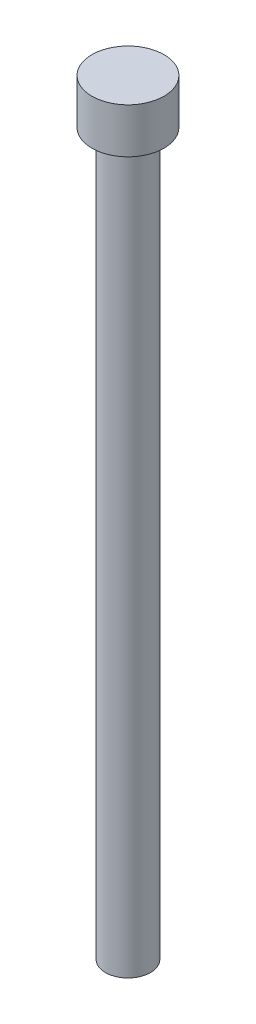
ISO-10303-21;
HEADER;
FILE_DESCRIPTION(('STEP AP214'),'2;1');
FILE_NAME('part.step','',(''),(''),'','','');
FILE_SCHEMA(('AUTOMOTIVE_DESIGN { 1 0 10303 214 1 1 1 1 }'));
ENDSEC;
DATA;
#1=APPLICATION_CONTEXT('core data for automotive mechanical design processes');
#2=APPLICATION_PROTOCOL_DEFINITION('international standard','automotive_design',2000,#1);
#3=PRODUCT_CONTEXT('',#1,'mechanical');
#4=PRODUCT('Part','Part','',(#3));
#5=PRODUCT_RELATED_PRODUCT_CATEGORY('part','',(#4));
#6=PRODUCT_DEFINITION_FORMATION('','',#4);
#7=PRODUCT_DEFINITION_CONTEXT('part definition',#1,'design');
#8=PRODUCT_DEFINITION('design','',#6,#7);
#9=PRODUCT_DEFINITION_SHAPE('','',#8);
#10=(LENGTH_UNIT() NAMED_UNIT(*) SI_UNIT(.MILLI.,.METRE.));
#11=(NAMED_UNIT(*) PLANE_ANGLE_UNIT() SI_UNIT($,.RADIAN.));
#12=(NAMED_UNIT(*) SI_UNIT($,.STERADIAN.) SOLID_ANGLE_UNIT());
#13=UNCERTAINTY_MEASURE_WITH_UNIT(LENGTH_MEASURE(1.E-05),#10,'distance_accuracy_value','');
#14=(GEOMETRIC_REPRESENTATION_CONTEXT(3) GLOBAL_UNCERTAINTY_ASSIGNED_CONTEXT((#13)) GLOBAL_UNIT_ASSIGNED_CONTEXT((#10,
#11,#12)) REPRESENTATION_CONTEXT('',''));
#15=CARTESIAN_POINT('',(0.,0.,0.));
#16=DIRECTION('',(0.,0.,1.));
#17=DIRECTION('',(1.,0.,0.));
#18=AXIS2_PLACEMENT_3D('',#15,#16,#17);
#19=CARTESIAN_POINT('',(0.,101.6,0.));
#20=DIRECTION('',(0.,-1.,0.));
#21=DIRECTION('',(0.,0.,-1.));
#22=AXIS2_PLACEMENT_3D('',#19,#20,#21);
#23=CYLINDRICAL_SURFACE('',#22,3.175);
#24=CARTESIAN_POINT('',(0.,101.6,0.));
#25=DIRECTION('',(0.,1.,0.));
#26=DIRECTION('',(0.,0.,1.));
#27=AXIS2_PLACEMENT_3D('',#24,#25,#26);
#28=CIRCLE('',#27,3.175);
#29=CARTESIAN_POINT('',(0.,101.6,3.175));
#30=VERTEX_POINT('',#29);
#31=EDGE_CURVE('E10',#30,#30,#28,.T.);
#32=ORIENTED_EDGE('',*,*,#31,.F.);
#33=EDGE_LOOP('',(#32));
#34=FACE_BOUND('',#33,.T.);
#35=CARTESIAN_POINT('',(0.,0.,0.));
#36=DIRECTION('',(0.,1.,0.));
#37=DIRECTION('',(0.,0.,1.));
#38=AXIS2_PLACEMENT_3D('',#35,#36,#37);
#39=CIRCLE('',#38,3.175);
#40=CARTESIAN_POINT('',(0.,0.,3.175));
#41=VERTEX_POINT('',#40);
#42=EDGE_CURVE('E44',#41,#41,#39,.T.);
#43=ORIENTED_EDGE('',*,*,#42,.T.);
#44=EDGE_LOOP('',(#43));
#45=FACE_BOUND('',#44,.T.);
#46=ADVANCED_FACE('F41',(#34,#45),#23,.T.);
#47=CARTESIAN_POINT('',(0.,0.,0.));
#48=DIRECTION('',(0.,1.,0.));
#49=DIRECTION('',(0.,0.,1.));
#50=AXIS2_PLACEMENT_3D('',#47,#48,#49);
#51=PLANE('',#50);
#52=ORIENTED_EDGE('',*,*,#42,.F.);
#53=EDGE_LOOP('',(#52));
#54=FACE_BOUND('',#53,.T.);
#55=ADVANCED_FACE('F68',(#54),#51,.F.);
#56=CARTESIAN_POINT('',(0.,107.95,0.));
#57=DIRECTION('',(0.,-1.,0.));
#58=DIRECTION('',(0.,0.,-1.));
#59=AXIS2_PLACEMENT_3D('',#56,#57,#58);
#60=CYLINDRICAL_SURFACE('',#59,5.08);
#61=CARTESIAN_POINT('',(0.,107.95,0.));
#62=DIRECTION('',(0.,1.,0.));
#63=DIRECTION('',(0.,0.,1.));
#64=AXIS2_PLACEMENT_3D('',#61,#62,#63);
#65=CIRCLE('',#64,5.08);
#66=CARTESIAN_POINT('',(0.,107.95,5.08));
#67=VERTEX_POINT('',#66);
#68=EDGE_CURVE('E53',#67,#67,#65,.T.);
#69=ORIENTED_EDGE('',*,*,#68,.F.);
#70=EDGE_LOOP('',(#69));
#71=FACE_BOUND('',#70,.T.);
#72=CARTESIAN_POINT('',(0.,101.6,0.));
#73=DIRECTION('',(0.,1.,0.));
#74=DIRECTION('',(0.,0.,1.));
#75=AXIS2_PLACEMENT_3D('',#72,#73,#74);
#76=CIRCLE('',#75,5.08);
#77=CARTESIAN_POINT('',(0.,101.6,5.08));
#78=VERTEX_POINT('',#77);
#79=EDGE_CURVE('E55',#78,#78,#76,.T.);
#80=ORIENTED_EDGE('',*,*,#79,.T.);
#81=EDGE_LOOP('',(#80));
#82=FACE_BOUND('',#81,.T.);
#83=ADVANCED_FACE('F65',(#71,#82),#60,.T.);
#84=CARTESIAN_POINT('',(0.,107.95,0.));
#85=DIRECTION('',(0.,1.,0.));
#86=DIRECTION('',(0.,0.,1.));
#87=AXIS2_PLACEMENT_3D('',#84,#85,#86);
#88=PLANE('',#87);
#89=ORIENTED_EDGE('',*,*,#68,.T.);
#90=EDGE_LOOP('',(#89));
#91=FACE_BOUND('',#90,.T.);
#92=ADVANCED_FACE('F63',(#91),#88,.T.);
#93=CARTESIAN_POINT('',(0.,101.6,0.));
#94=DIRECTION('',(0.,1.,0.));
#95=DIRECTION('',(0.,0.,1.));
#96=AXIS2_PLACEMENT_3D('',#93,#94,#95);
#97=PLANE('',#96);
#98=ORIENTED_EDGE('',*,*,#31,.T.);
#99=EDGE_LOOP('',(#98));
#100=FACE_BOUND('',#99,.T.);
#101=ORIENTED_EDGE('',*,*,#79,.F.);
#102=EDGE_LOOP('',(#101));
#103=FACE_BOUND('',#102,.T.);
#104=ADVANCED_FACE('F72',(#100,#103),#97,.F.);
#105=CLOSED_SHELL('',(#46,#55,#83,#92,#104));
#106=MANIFOLD_SOLID_BREP('B2',#105);
#107=ADVANCED_BREP_SHAPE_REPRESENTATION('',(#18,#106),#14);
#108=SHAPE_DEFINITION_REPRESENTATION(#9,#107);
ENDSEC;
END-ISO-10303-21;
